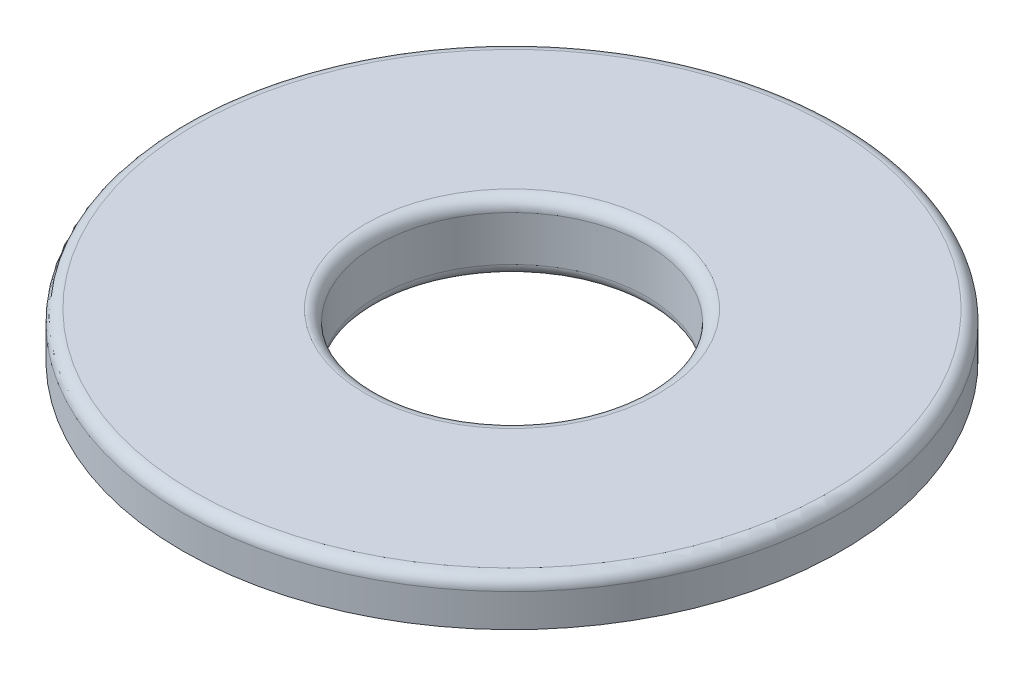
ISO-10303-21;
HEADER;
FILE_DESCRIPTION(('STEP AP214'),'2;1');
FILE_NAME('part.step','',(''),(''),'','','');
FILE_SCHEMA(('AUTOMOTIVE_DESIGN { 1 0 10303 214 1 1 1 1 }'));
ENDSEC;
DATA;
#1=APPLICATION_CONTEXT('core data for automotive mechanical design processes');
#2=APPLICATION_PROTOCOL_DEFINITION('international standard','automotive_design',2000,#1);
#3=PRODUCT_CONTEXT('',#1,'mechanical');
#4=PRODUCT('Part','Part','',(#3));
#5=PRODUCT_RELATED_PRODUCT_CATEGORY('part','',(#4));
#6=PRODUCT_DEFINITION_FORMATION('','',#4);
#7=PRODUCT_DEFINITION_CONTEXT('part definition',#1,'design');
#8=PRODUCT_DEFINITION('design','',#6,#7);
#9=PRODUCT_DEFINITION_SHAPE('','',#8);
#10=(LENGTH_UNIT() NAMED_UNIT(*) SI_UNIT(.MILLI.,.METRE.));
#11=(NAMED_UNIT(*) PLANE_ANGLE_UNIT() SI_UNIT($,.RADIAN.));
#12=(NAMED_UNIT(*) SI_UNIT($,.STERADIAN.) SOLID_ANGLE_UNIT());
#13=UNCERTAINTY_MEASURE_WITH_UNIT(LENGTH_MEASURE(1.E-05),#10,'distance_accuracy_value','');
#14=(GEOMETRIC_REPRESENTATION_CONTEXT(3) GLOBAL_UNCERTAINTY_ASSIGNED_CONTEXT((#13)) GLOBAL_UNIT_ASSIGNED_CONTEXT((#10,
#11,#12)) REPRESENTATION_CONTEXT('',''));
#15=CARTESIAN_POINT('',(0.,0.,0.));
#16=DIRECTION('',(0.,0.,1.));
#17=DIRECTION('',(1.,0.,0.));
#18=AXIS2_PLACEMENT_3D('',#15,#16,#17);
#19=CARTESIAN_POINT('',(0.,2.54,0.));
#20=DIRECTION('',(0.,-1.,0.));
#21=DIRECTION('',(0.,0.,-1.));
#22=AXIS2_PLACEMENT_3D('',#19,#20,#21);
#23=CYLINDRICAL_SURFACE('',#22,28.2575);
#24=CARTESIAN_POINT('',(0.,1.27,0.));
#25=DIRECTION('',(0.,1.,0.));
#26=DIRECTION('',(0.,0.,1.));
#27=AXIS2_PLACEMENT_3D('',#24,#25,#26);
#28=CIRCLE('',#27,28.2575);
#29=CARTESIAN_POINT('',(0.,1.27,28.2575));
#30=VERTEX_POINT('',#29);
#31=EDGE_CURVE('E60',#30,#30,#28,.T.);
#32=ORIENTED_EDGE('',*,*,#31,.T.);
#33=EDGE_LOOP('',(#32));
#34=FACE_BOUND('',#33,.T.);
#35=CARTESIAN_POINT('',(0.,2.54,0.));
#36=DIRECTION('',(0.,1.,0.));
#37=DIRECTION('',(0.,0.,1.));
#38=AXIS2_PLACEMENT_3D('',#35,#36,#37);
#39=CIRCLE('',#38,28.2575);
#40=CARTESIAN_POINT('',(0.,2.54,28.2575));
#41=VERTEX_POINT('',#40);
#42=EDGE_CURVE('E63',#41,#41,#39,.T.);
#43=ORIENTED_EDGE('',*,*,#42,.F.);
#44=EDGE_LOOP('',(#43));
#45=FACE_BOUND('',#44,.T.);
#46=ADVANCED_FACE('F31',(#34,#45),#23,.T.);
#47=CARTESIAN_POINT('',(0.,0.,0.));
#48=DIRECTION('',(0.,1.,0.));
#49=DIRECTION('',(0.,0.,1.));
#50=AXIS2_PLACEMENT_3D('',#47,#48,#49);
#51=PLANE('',#50);
#52=CARTESIAN_POINT('',(0.,0.,0.));
#53=DIRECTION('',(0.,1.,0.));
#54=DIRECTION('',(0.,0.,1.));
#55=AXIS2_PLACEMENT_3D('',#52,#53,#54);
#56=CIRCLE('',#55,26.9875);
#57=CARTESIAN_POINT('',(0.,0.,26.9875));
#58=VERTEX_POINT('',#57);
#59=EDGE_CURVE('E54',#58,#58,#56,.F.);
#60=ORIENTED_EDGE('',*,*,#59,.T.);
#61=EDGE_LOOP('',(#60));
#62=FACE_BOUND('',#61,.T.);
#63=CARTESIAN_POINT('',(0.,0.,0.));
#64=DIRECTION('',(0.,1.,0.));
#65=DIRECTION('',(0.,0.,1.));
#66=AXIS2_PLACEMENT_3D('',#63,#64,#65);
#67=CIRCLE('',#66,15.5575);
#68=CARTESIAN_POINT('',(0.,0.,15.5575));
#69=VERTEX_POINT('',#68);
#70=EDGE_CURVE('E57',#69,#69,#67,.T.);
#71=ORIENTED_EDGE('',*,*,#70,.T.);
#72=EDGE_LOOP('',(#71));
#73=FACE_BOUND('',#72,.T.);
#74=ADVANCED_FACE('F88',(#62,#73),#51,.F.);
#75=CARTESIAN_POINT('',(0.,7.3025,0.));
#76=DIRECTION('',(0.,-1.,0.));
#77=DIRECTION('',(0.,0.,-1.));
#78=AXIS2_PLACEMENT_3D('',#75,#76,#77);
#79=CYLINDRICAL_SURFACE('',#78,34.925);
#80=CARTESIAN_POINT('',(0.,6.0325,0.));
#81=DIRECTION('',(0.,1.,0.));
#82=DIRECTION('',(0.,0.,1.));
#83=AXIS2_PLACEMENT_3D('',#80,#81,#82);
#84=CIRCLE('',#83,34.925);
#85=CARTESIAN_POINT('',(0.,6.0325,34.925));
#86=VERTEX_POINT('',#85);
#87=EDGE_CURVE('E10',#86,#86,#84,.F.);
#88=ORIENTED_EDGE('',*,*,#87,.T.);
#89=EDGE_LOOP('',(#88));
#90=FACE_BOUND('',#89,.T.);
#91=CARTESIAN_POINT('',(0.,2.54,0.));
#92=DIRECTION('',(0.,1.,0.));
#93=DIRECTION('',(0.,0.,1.));
#94=AXIS2_PLACEMENT_3D('',#91,#92,#93);
#95=CIRCLE('',#94,34.925);
#96=CARTESIAN_POINT('',(0.,2.54,34.925));
#97=VERTEX_POINT('',#96);
#98=EDGE_CURVE('E66',#97,#97,#95,.T.);
#99=ORIENTED_EDGE('',*,*,#98,.T.);
#100=EDGE_LOOP('',(#99));
#101=FACE_BOUND('',#100,.T.);
#102=ADVANCED_FACE('F70',(#90,#101),#79,.T.);
#103=CARTESIAN_POINT('',(0.,7.3025,0.));
#104=DIRECTION('',(0.,1.,0.));
#105=DIRECTION('',(0.,0.,1.));
#106=AXIS2_PLACEMENT_3D('',#103,#104,#105);
#107=PLANE('',#106);
#108=CARTESIAN_POINT('',(0.,7.3025,0.));
#109=DIRECTION('',(0.,1.,0.));
#110=DIRECTION('',(0.,0.,1.));
#111=AXIS2_PLACEMENT_3D('',#108,#109,#110);
#112=CIRCLE('',#111,33.655);
#113=CARTESIAN_POINT('',(0.,7.3025,33.655));
#114=VERTEX_POINT('',#113);
#115=EDGE_CURVE('E38',#114,#114,#112,.T.);
#116=ORIENTED_EDGE('',*,*,#115,.T.);
#117=EDGE_LOOP('',(#116));
#118=FACE_BOUND('',#117,.T.);
#119=CARTESIAN_POINT('',(0.,7.3025,0.));
#120=DIRECTION('',(0.,1.,0.));
#121=DIRECTION('',(0.,0.,1.));
#122=AXIS2_PLACEMENT_3D('',#119,#120,#121);
#123=CIRCLE('',#122,15.5575);
#124=CARTESIAN_POINT('',(0.,7.3025,15.5575));
#125=VERTEX_POINT('',#124);
#126=EDGE_CURVE('E42',#125,#125,#123,.F.);
#127=ORIENTED_EDGE('',*,*,#126,.T.);
#128=EDGE_LOOP('',(#127));
#129=FACE_BOUND('',#128,.T.);
#130=ADVANCED_FACE('F75',(#118,#129),#107,.T.);
#131=CARTESIAN_POINT('',(0.,2.54,0.));
#132=DIRECTION('',(0.,1.,0.));
#133=DIRECTION('',(0.,0.,1.));
#134=AXIS2_PLACEMENT_3D('',#131,#132,#133);
#135=PLANE('',#134);
#136=ORIENTED_EDGE('',*,*,#42,.T.);
#137=EDGE_LOOP('',(#136));
#138=FACE_BOUND('',#137,.T.);
#139=ORIENTED_EDGE('',*,*,#98,.F.);
#140=EDGE_LOOP('',(#139));
#141=FACE_BOUND('',#140,.T.);
#142=ADVANCED_FACE('F72',(#138,#141),#135,.F.);
#143=CARTESIAN_POINT('',(0.,7.3035,0.));
#144=DIRECTION('',(0.,-1.,0.));
#145=DIRECTION('',(0.,0.,-1.));
#146=AXIS2_PLACEMENT_3D('',#143,#144,#145);
#147=CYLINDRICAL_SURFACE('',#146,14.2875);
#148=CARTESIAN_POINT('',(0.,1.27,0.));
#149=DIRECTION('',(0.,1.,0.));
#150=DIRECTION('',(0.,0.,1.));
#151=AXIS2_PLACEMENT_3D('',#148,#149,#150);
#152=CIRCLE('',#151,14.2875);
#153=CARTESIAN_POINT('',(0.,1.27,14.2875));
#154=VERTEX_POINT('',#153);
#155=EDGE_CURVE('E46',#154,#154,#152,.F.);
#156=ORIENTED_EDGE('',*,*,#155,.T.);
#157=EDGE_LOOP('',(#156));
#158=FACE_BOUND('',#157,.T.);
#159=CARTESIAN_POINT('',(0.,6.0325,0.));
#160=DIRECTION('',(0.,1.,0.));
#161=DIRECTION('',(0.,0.,1.));
#162=AXIS2_PLACEMENT_3D('',#159,#160,#161);
#163=CIRCLE('',#162,14.2875);
#164=CARTESIAN_POINT('',(0.,6.0325,14.2875));
#165=VERTEX_POINT('',#164);
#166=EDGE_CURVE('E51',#165,#165,#163,.T.);
#167=ORIENTED_EDGE('',*,*,#166,.T.);
#168=EDGE_LOOP('',(#167));
#169=FACE_BOUND('',#168,.T.);
#170=ADVANCED_FACE('F74',(#158,#169),#147,.F.);
#171=CARTESIAN_POINT('',(0.,1.27,0.));
#172=DIRECTION('',(0.,1.,0.));
#173=DIRECTION('',(0.,0.,1.));
#174=AXIS2_PLACEMENT_3D('',#171,#172,#173);
#175=TOROIDAL_SURFACE('',#174,26.9875,1.27);
#176=ORIENTED_EDGE('',*,*,#59,.F.);
#177=EDGE_LOOP('',(#176));
#178=FACE_BOUND('',#177,.T.);
#179=ORIENTED_EDGE('',*,*,#31,.F.);
#180=EDGE_LOOP('',(#179));
#181=FACE_BOUND('',#180,.T.);
#182=ADVANCED_FACE('F82',(#178,#181),#175,.T.);
#183=CARTESIAN_POINT('',(0.,1.27,0.));
#184=DIRECTION('',(0.,1.,0.));
#185=DIRECTION('',(0.,0.,1.));
#186=AXIS2_PLACEMENT_3D('',#183,#184,#185);
#187=TOROIDAL_SURFACE('',#186,15.5575,1.27);
#188=ORIENTED_EDGE('',*,*,#70,.F.);
#189=EDGE_LOOP('',(#188));
#190=FACE_BOUND('',#189,.T.);
#191=ORIENTED_EDGE('',*,*,#155,.F.);
#192=EDGE_LOOP('',(#191));
#193=FACE_BOUND('',#192,.T.);
#194=ADVANCED_FACE('F100',(#190,#193),#187,.T.);
#195=CARTESIAN_POINT('',(0.,6.0325,0.));
#196=DIRECTION('',(0.,1.,0.));
#197=DIRECTION('',(0.,0.,1.));
#198=AXIS2_PLACEMENT_3D('',#195,#196,#197);
#199=TOROIDAL_SURFACE('',#198,33.655,1.27);
#200=ORIENTED_EDGE('',*,*,#87,.F.);
#201=EDGE_LOOP('',(#200));
#202=FACE_BOUND('',#201,.T.);
#203=ORIENTED_EDGE('',*,*,#115,.F.);
#204=EDGE_LOOP('',(#203));
#205=FACE_BOUND('',#204,.T.);
#206=ADVANCED_FACE('F103',(#202,#205),#199,.T.);
#207=CARTESIAN_POINT('',(0.,6.0325,0.));
#208=DIRECTION('',(0.,1.,0.));
#209=DIRECTION('',(0.,0.,1.));
#210=AXIS2_PLACEMENT_3D('',#207,#208,#209);
#211=TOROIDAL_SURFACE('',#210,15.5575,1.27);
#212=ORIENTED_EDGE('',*,*,#166,.F.);
#213=EDGE_LOOP('',(#212));
#214=FACE_BOUND('',#213,.T.);
#215=ORIENTED_EDGE('',*,*,#126,.F.);
#216=EDGE_LOOP('',(#215));
#217=FACE_BOUND('',#216,.T.);
#218=ADVANCED_FACE('F33',(#214,#217),#211,.T.);
#219=CLOSED_SHELL('',(#46,#74,#102,#130,#142,#170,#182,#194,#206,#218));
#220=MANIFOLD_SOLID_BREP('B2',#219);
#221=ADVANCED_BREP_SHAPE_REPRESENTATION('',(#18,#220),#14);
#222=SHAPE_DEFINITION_REPRESENTATION(#9,#221);
ENDSEC;
END-ISO-10303-21;
